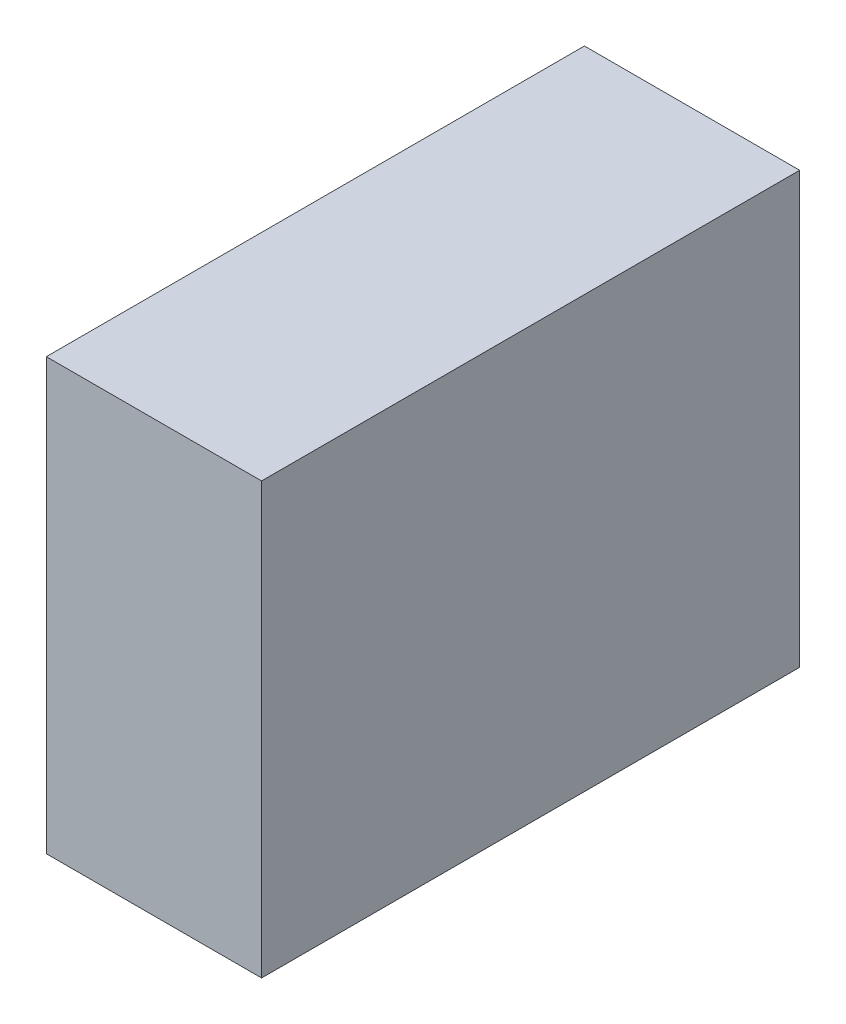
ISO-10303-21;
HEADER;
FILE_DESCRIPTION(('STEP AP214'),'2;1');
FILE_NAME('part.step','',(''),(''),'','','');
FILE_SCHEMA(('AUTOMOTIVE_DESIGN { 1 0 10303 214 1 1 1 1 }'));
ENDSEC;
DATA;
#1=APPLICATION_CONTEXT('core data for automotive mechanical design processes');
#2=APPLICATION_PROTOCOL_DEFINITION('international standard','automotive_design',2000,#1);
#3=PRODUCT_CONTEXT('',#1,'mechanical');
#4=PRODUCT('Part','Part','',(#3));
#5=PRODUCT_RELATED_PRODUCT_CATEGORY('part','',(#4));
#6=PRODUCT_DEFINITION_FORMATION('','',#4);
#7=PRODUCT_DEFINITION_CONTEXT('part definition',#1,'design');
#8=PRODUCT_DEFINITION('design','',#6,#7);
#9=PRODUCT_DEFINITION_SHAPE('','',#8);
#10=(LENGTH_UNIT() NAMED_UNIT(*) SI_UNIT(.MILLI.,.METRE.));
#11=(NAMED_UNIT(*) PLANE_ANGLE_UNIT() SI_UNIT($,.RADIAN.));
#12=(NAMED_UNIT(*) SI_UNIT($,.STERADIAN.) SOLID_ANGLE_UNIT());
#13=UNCERTAINTY_MEASURE_WITH_UNIT(LENGTH_MEASURE(1.E-05),#10,'distance_accuracy_value','');
#14=(GEOMETRIC_REPRESENTATION_CONTEXT(3) GLOBAL_UNCERTAINTY_ASSIGNED_CONTEXT((#13)) GLOBAL_UNIT_ASSIGNED_CONTEXT((#10,
#11,#12)) REPRESENTATION_CONTEXT('',''));
#15=CARTESIAN_POINT('',(0.,0.,0.));
#16=DIRECTION('',(0.,0.,1.));
#17=DIRECTION('',(1.,0.,0.));
#18=AXIS2_PLACEMENT_3D('',#15,#16,#17);
#19=CARTESIAN_POINT('',(200.,200.,-250.));
#20=DIRECTION('',(0.,0.,1.));
#21=DIRECTION('',(0.,-1.,0.));
#22=AXIS2_PLACEMENT_3D('',#19,#20,#21);
#23=PLANE('',#22);
#24=DIRECTION('',(0.,1.,0.));
#25=VECTOR('',#24,1.);
#26=CARTESIAN_POINT('',(0.,200.,-250.));
#27=LINE('',#26,#25);
#28=CARTESIAN_POINT('',(0.,-200.,-250.));
#29=VERTEX_POINT('',#28);
#30=CARTESIAN_POINT('',(0.,200.,-250.));
#31=VERTEX_POINT('',#30);
#32=EDGE_CURVE('E97',#29,#31,#27,.T.);
#33=ORIENTED_EDGE('',*,*,#32,.T.);
#34=DIRECTION('',(-1.,0.,0.));
#35=VECTOR('',#34,1.);
#36=CARTESIAN_POINT('',(200.,200.,-250.));
#37=LINE('',#36,#35);
#38=CARTESIAN_POINT('',(200.,200.,-250.));
#39=VERTEX_POINT('',#38);
#40=EDGE_CURVE('E11',#39,#31,#37,.T.);
#41=ORIENTED_EDGE('',*,*,#40,.F.);
#42=DIRECTION('',(0.,1.,0.));
#43=VECTOR('',#42,1.);
#44=CARTESIAN_POINT('',(200.,200.,-250.));
#45=LINE('',#44,#43);
#46=CARTESIAN_POINT('',(200.,-200.,-250.));
#47=VERTEX_POINT('',#46);
#48=EDGE_CURVE('E85',#47,#39,#45,.T.);
#49=ORIENTED_EDGE('',*,*,#48,.F.);
#50=DIRECTION('',(-1.,0.,0.));
#51=VECTOR('',#50,1.);
#52=CARTESIAN_POINT('',(200.,-200.,-250.));
#53=LINE('',#52,#51);
#54=EDGE_CURVE('E93',#47,#29,#53,.T.);
#55=ORIENTED_EDGE('',*,*,#54,.T.);
#56=EDGE_LOOP('',(#33,#41,#49,#55));
#57=FACE_BOUND('',#56,.T.);
#58=ADVANCED_FACE('F34',(#57),#23,.F.);
#59=CARTESIAN_POINT('',(200.,200.,250.));
#60=DIRECTION('',(0.,-1.,0.));
#61=DIRECTION('',(0.,0.,-1.));
#62=AXIS2_PLACEMENT_3D('',#59,#60,#61);
#63=PLANE('',#62);
#64=DIRECTION('',(0.,0.,1.));
#65=VECTOR('',#64,1.);
#66=CARTESIAN_POINT('',(0.,200.,250.));
#67=LINE('',#66,#65);
#68=CARTESIAN_POINT('',(0.,200.,250.));
#69=VERTEX_POINT('',#68);
#70=EDGE_CURVE('E89',#31,#69,#67,.T.);
#71=ORIENTED_EDGE('',*,*,#70,.T.);
#72=DIRECTION('',(-1.,0.,0.));
#73=VECTOR('',#72,1.);
#74=CARTESIAN_POINT('',(200.,200.,250.));
#75=LINE('',#74,#73);
#76=CARTESIAN_POINT('',(200.,200.,250.));
#77=VERTEX_POINT('',#76);
#78=EDGE_CURVE('E42',#77,#69,#75,.T.);
#79=ORIENTED_EDGE('',*,*,#78,.F.);
#80=DIRECTION('',(0.,0.,1.));
#81=VECTOR('',#80,1.);
#82=CARTESIAN_POINT('',(200.,200.,250.));
#83=LINE('',#82,#81);
#84=EDGE_CURVE('E80',#39,#77,#83,.T.);
#85=ORIENTED_EDGE('',*,*,#84,.F.);
#86=ORIENTED_EDGE('',*,*,#40,.T.);
#87=EDGE_LOOP('',(#71,#79,#85,#86));
#88=FACE_BOUND('',#87,.T.);
#89=ADVANCED_FACE('F88',(#88),#63,.F.);
#90=CARTESIAN_POINT('',(200.,200.,250.));
#91=DIRECTION('',(0.,0.,-1.));
#92=DIRECTION('',(0.,1.,0.));
#93=AXIS2_PLACEMENT_3D('',#90,#91,#92);
#94=PLANE('',#93);
#95=DIRECTION('',(0.,-1.,0.));
#96=VECTOR('',#95,1.);
#97=CARTESIAN_POINT('',(0.,200.,250.));
#98=LINE('',#97,#96);
#99=CARTESIAN_POINT('',(0.,-200.,250.));
#100=VERTEX_POINT('',#99);
#101=EDGE_CURVE('E67',#69,#100,#98,.T.);
#102=ORIENTED_EDGE('',*,*,#101,.T.);
#103=DIRECTION('',(-1.,0.,0.));
#104=VECTOR('',#103,1.);
#105=CARTESIAN_POINT('',(200.,-200.,250.));
#106=LINE('',#105,#104);
#107=CARTESIAN_POINT('',(200.,-200.,250.));
#108=VERTEX_POINT('',#107);
#109=EDGE_CURVE('E90',#108,#100,#106,.T.);
#110=ORIENTED_EDGE('',*,*,#109,.F.);
#111=DIRECTION('',(0.,-1.,0.));
#112=VECTOR('',#111,1.);
#113=CARTESIAN_POINT('',(200.,200.,250.));
#114=LINE('',#113,#112);
#115=EDGE_CURVE('E83',#77,#108,#114,.T.);
#116=ORIENTED_EDGE('',*,*,#115,.F.);
#117=ORIENTED_EDGE('',*,*,#78,.T.);
#118=EDGE_LOOP('',(#102,#110,#116,#117));
#119=FACE_BOUND('',#118,.T.);
#120=ADVANCED_FACE('F91',(#119),#94,.F.);
#121=CARTESIAN_POINT('',(200.,-200.,250.));
#122=DIRECTION('',(0.,1.,0.));
#123=DIRECTION('',(0.,0.,1.));
#124=AXIS2_PLACEMENT_3D('',#121,#122,#123);
#125=PLANE('',#124);
#126=DIRECTION('',(0.,0.,-1.));
#127=VECTOR('',#126,1.);
#128=CARTESIAN_POINT('',(0.,-200.,250.));
#129=LINE('',#128,#127);
#130=EDGE_CURVE('E73',#100,#29,#129,.T.);
#131=ORIENTED_EDGE('',*,*,#130,.T.);
#132=ORIENTED_EDGE('',*,*,#54,.F.);
#133=DIRECTION('',(0.,0.,-1.));
#134=VECTOR('',#133,1.);
#135=CARTESIAN_POINT('',(200.,-200.,250.));
#136=LINE('',#135,#134);
#137=EDGE_CURVE('E50',#108,#47,#136,.T.);
#138=ORIENTED_EDGE('',*,*,#137,.F.);
#139=ORIENTED_EDGE('',*,*,#109,.T.);
#140=EDGE_LOOP('',(#131,#132,#138,#139));
#141=FACE_BOUND('',#140,.T.);
#142=ADVANCED_FACE('F104',(#141),#125,.F.);
#143=CARTESIAN_POINT('',(200.,0.,0.));
#144=DIRECTION('',(1.,0.,0.));
#145=DIRECTION('',(0.,0.,-1.));
#146=AXIS2_PLACEMENT_3D('',#143,#144,#145);
#147=PLANE('',#146);
#148=ORIENTED_EDGE('',*,*,#48,.T.);
#149=ORIENTED_EDGE('',*,*,#84,.T.);
#150=ORIENTED_EDGE('',*,*,#115,.T.);
#151=ORIENTED_EDGE('',*,*,#137,.T.);
#152=EDGE_LOOP('',(#148,#149,#150,#151));
#153=FACE_BOUND('',#152,.T.);
#154=ADVANCED_FACE('F81',(#153),#147,.T.);
#155=CARTESIAN_POINT('',(0.,0.,0.));
#156=DIRECTION('',(1.,0.,0.));
#157=DIRECTION('',(0.,0.,-1.));
#158=AXIS2_PLACEMENT_3D('',#155,#156,#157);
#159=PLANE('',#158);
#160=ORIENTED_EDGE('',*,*,#32,.F.);
#161=ORIENTED_EDGE('',*,*,#130,.F.);
#162=ORIENTED_EDGE('',*,*,#101,.F.);
#163=ORIENTED_EDGE('',*,*,#70,.F.);
#164=EDGE_LOOP('',(#160,#161,#162,#163));
#165=FACE_BOUND('',#164,.T.);
#166=ADVANCED_FACE('F107',(#165),#159,.F.);
#167=CLOSED_SHELL('',(#58,#89,#120,#142,#154,#166));
#168=MANIFOLD_SOLID_BREP('B2',#167);
#169=ADVANCED_BREP_SHAPE_REPRESENTATION('',(#18,#168),#14);
#170=SHAPE_DEFINITION_REPRESENTATION(#9,#169);
ENDSEC;
END-ISO-10303-21;
